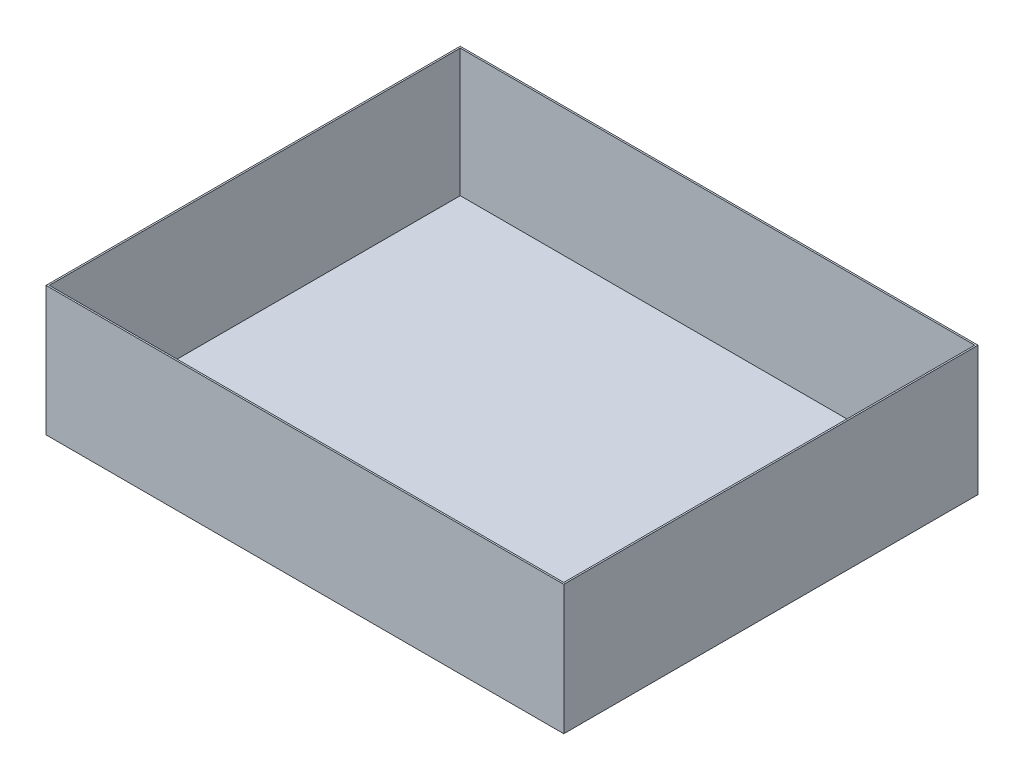
ISO-10303-21;
HEADER;
FILE_DESCRIPTION(('STEP AP214'),'2;1');
FILE_NAME('part.step','',(''),(''),'','','');
FILE_SCHEMA(('AUTOMOTIVE_DESIGN { 1 0 10303 214 1 1 1 1 }'));
ENDSEC;
DATA;
#1=APPLICATION_CONTEXT('core data for automotive mechanical design processes');
#2=APPLICATION_PROTOCOL_DEFINITION('international standard','automotive_design',2000,#1);
#3=PRODUCT_CONTEXT('',#1,'mechanical');
#4=PRODUCT('Part','Part','',(#3));
#5=PRODUCT_RELATED_PRODUCT_CATEGORY('part','',(#4));
#6=PRODUCT_DEFINITION_FORMATION('','',#4);
#7=PRODUCT_DEFINITION_CONTEXT('part definition',#1,'design');
#8=PRODUCT_DEFINITION('design','',#6,#7);
#9=PRODUCT_DEFINITION_SHAPE('','',#8);
#10=(LENGTH_UNIT() NAMED_UNIT(*) SI_UNIT(.MILLI.,.METRE.));
#11=(NAMED_UNIT(*) PLANE_ANGLE_UNIT() SI_UNIT($,.RADIAN.));
#12=(NAMED_UNIT(*) SI_UNIT($,.STERADIAN.) SOLID_ANGLE_UNIT());
#13=UNCERTAINTY_MEASURE_WITH_UNIT(LENGTH_MEASURE(1.E-05),#10,'distance_accuracy_value','');
#14=(GEOMETRIC_REPRESENTATION_CONTEXT(3) GLOBAL_UNCERTAINTY_ASSIGNED_CONTEXT((#13)) GLOBAL_UNIT_ASSIGNED_CONTEXT((#10,
#11,#12)) REPRESENTATION_CONTEXT('',''));
#15=CARTESIAN_POINT('',(0.,0.,0.));
#16=DIRECTION('',(0.,0.,1.));
#17=DIRECTION('',(1.,0.,0.));
#18=AXIS2_PLACEMENT_3D('',#15,#16,#17);
#19=CARTESIAN_POINT('',(0.,63.5,0.));
#20=DIRECTION('',(0.,-1.,0.));
#21=DIRECTION('',(0.,0.,-1.));
#22=AXIS2_PLACEMENT_3D('',#19,#20,#21);
#23=PLANE('',#22);
#24=DIRECTION('',(0.,0.,1.));
#25=VECTOR('',#24,1.);
#26=CARTESIAN_POINT('',(0.,63.5,0.));
#27=LINE('',#26,#25);
#28=CARTESIAN_POINT('',(0.,63.5,-203.2));
#29=VERTEX_POINT('',#28);
#30=CARTESIAN_POINT('',(0.,63.5,0.));
#31=VERTEX_POINT('',#30);
#32=EDGE_CURVE('E143',#29,#31,#27,.T.);
#33=ORIENTED_EDGE('',*,*,#32,.T.);
#34=DIRECTION('',(1.,0.,0.));
#35=VECTOR('',#34,1.);
#36=CARTESIAN_POINT('',(0.,63.5,0.));
#37=LINE('',#36,#35);
#38=CARTESIAN_POINT('',(254.,63.5,0.));
#39=VERTEX_POINT('',#38);
#40=EDGE_CURVE('E87',#31,#39,#37,.T.);
#41=ORIENTED_EDGE('',*,*,#40,.T.);
#42=DIRECTION('',(0.,0.,-1.));
#43=VECTOR('',#42,1.);
#44=CARTESIAN_POINT('',(254.,63.5,0.));
#45=LINE('',#44,#43);
#46=CARTESIAN_POINT('',(254.,63.5,-203.2));
#47=VERTEX_POINT('',#46);
#48=EDGE_CURVE('E146',#39,#47,#45,.T.);
#49=ORIENTED_EDGE('',*,*,#48,.T.);
#50=DIRECTION('',(-1.,0.,0.));
#51=VECTOR('',#50,1.);
#52=CARTESIAN_POINT('',(0.,63.5,-203.2));
#53=LINE('',#52,#51);
#54=EDGE_CURVE('E59',#47,#29,#53,.T.);
#55=ORIENTED_EDGE('',*,*,#54,.T.);
#56=EDGE_LOOP('',(#33,#41,#49,#55));
#57=FACE_BOUND('',#56,.T.);
#58=DIRECTION('',(0.,0.,1.));
#59=VECTOR('',#58,1.);
#60=CARTESIAN_POINT('',(0.79375,63.5,0.));
#61=LINE('',#60,#59);
#62=CARTESIAN_POINT('',(0.79375,63.5,-202.40625));
#63=VERTEX_POINT('',#62);
#64=CARTESIAN_POINT('',(0.79375,63.5,-0.79375));
#65=VERTEX_POINT('',#64);
#66=EDGE_CURVE('E132',#63,#65,#61,.T.);
#67=ORIENTED_EDGE('',*,*,#66,.F.);
#68=DIRECTION('',(-1.,0.,0.));
#69=VECTOR('',#68,1.);
#70=CARTESIAN_POINT('',(0.,63.5,-202.40625));
#71=LINE('',#70,#69);
#72=CARTESIAN_POINT('',(253.20625,63.5,-202.40625));
#73=VERTEX_POINT('',#72);
#74=EDGE_CURVE('E141',#73,#63,#71,.T.);
#75=ORIENTED_EDGE('',*,*,#74,.F.);
#76=DIRECTION('',(0.,0.,-1.));
#77=VECTOR('',#76,1.);
#78=CARTESIAN_POINT('',(253.20625,63.5,0.));
#79=LINE('',#78,#77);
#80=CARTESIAN_POINT('',(253.20625,63.5,-0.79375));
#81=VERTEX_POINT('',#80);
#82=EDGE_CURVE('E139',#81,#73,#79,.T.);
#83=ORIENTED_EDGE('',*,*,#82,.F.);
#84=DIRECTION('',(1.,0.,0.));
#85=VECTOR('',#84,1.);
#86=CARTESIAN_POINT('',(0.,63.5,-0.79375));
#87=LINE('',#86,#85);
#88=EDGE_CURVE('E124',#65,#81,#87,.T.);
#89=ORIENTED_EDGE('',*,*,#88,.F.);
#90=EDGE_LOOP('',(#67,#75,#83,#89));
#91=FACE_BOUND('',#90,.T.);
#92=ADVANCED_FACE('F35',(#57,#91),#23,.F.);
#93=CARTESIAN_POINT('',(0.,63.5,0.));
#94=DIRECTION('',(1.,0.,0.));
#95=DIRECTION('',(0.,0.,-1.));
#96=AXIS2_PLACEMENT_3D('',#93,#94,#95);
#97=PLANE('',#96);
#98=DIRECTION('',(0.,0.,1.));
#99=VECTOR('',#98,1.);
#100=CARTESIAN_POINT('',(0.,0.,0.));
#101=LINE('',#100,#99);
#102=CARTESIAN_POINT('',(0.,0.,-203.2));
#103=VERTEX_POINT('',#102);
#104=CARTESIAN_POINT('',(0.,0.,0.));
#105=VERTEX_POINT('',#104);
#106=EDGE_CURVE('E150',#103,#105,#101,.T.);
#107=ORIENTED_EDGE('',*,*,#106,.T.);
#108=DIRECTION('',(0.,-1.,0.));
#109=VECTOR('',#108,1.);
#110=CARTESIAN_POINT('',(0.,63.5,0.));
#111=LINE('',#110,#109);
#112=EDGE_CURVE('E11',#31,#105,#111,.T.);
#113=ORIENTED_EDGE('',*,*,#112,.F.);
#114=ORIENTED_EDGE('',*,*,#32,.F.);
#115=DIRECTION('',(0.,-1.,0.));
#116=VECTOR('',#115,1.);
#117=CARTESIAN_POINT('',(0.,63.5,-203.2));
#118=LINE('',#117,#116);
#119=EDGE_CURVE('E149',#29,#103,#118,.T.);
#120=ORIENTED_EDGE('',*,*,#119,.T.);
#121=EDGE_LOOP('',(#107,#113,#114,#120));
#122=FACE_BOUND('',#121,.T.);
#123=ADVANCED_FACE('F37',(#122),#97,.F.);
#124=CARTESIAN_POINT('',(0.,63.5,0.));
#125=DIRECTION('',(0.,0.,-1.));
#126=DIRECTION('',(-1.,0.,0.));
#127=AXIS2_PLACEMENT_3D('',#124,#125,#126);
#128=PLANE('',#127);
#129=DIRECTION('',(1.,0.,0.));
#130=VECTOR('',#129,1.);
#131=CARTESIAN_POINT('',(0.,0.,0.));
#132=LINE('',#131,#130);
#133=CARTESIAN_POINT('',(254.,0.,0.));
#134=VERTEX_POINT('',#133);
#135=EDGE_CURVE('E153',#105,#134,#132,.T.);
#136=ORIENTED_EDGE('',*,*,#135,.T.);
#137=DIRECTION('',(0.,-1.,0.));
#138=VECTOR('',#137,1.);
#139=CARTESIAN_POINT('',(254.,63.5,0.));
#140=LINE('',#139,#138);
#141=EDGE_CURVE('E43',#39,#134,#140,.T.);
#142=ORIENTED_EDGE('',*,*,#141,.F.);
#143=ORIENTED_EDGE('',*,*,#40,.F.);
#144=ORIENTED_EDGE('',*,*,#112,.T.);
#145=EDGE_LOOP('',(#136,#142,#143,#144));
#146=FACE_BOUND('',#145,.T.);
#147=ADVANCED_FACE('F181',(#146),#128,.F.);
#148=CARTESIAN_POINT('',(254.,63.5,0.));
#149=DIRECTION('',(-1.,0.,0.));
#150=DIRECTION('',(0.,0.,1.));
#151=AXIS2_PLACEMENT_3D('',#148,#149,#150);
#152=PLANE('',#151);
#153=DIRECTION('',(0.,0.,-1.));
#154=VECTOR('',#153,1.);
#155=CARTESIAN_POINT('',(254.,0.,0.));
#156=LINE('',#155,#154);
#157=CARTESIAN_POINT('',(254.,0.,-203.2));
#158=VERTEX_POINT('',#157);
#159=EDGE_CURVE('E155',#134,#158,#156,.T.);
#160=ORIENTED_EDGE('',*,*,#159,.T.);
#161=DIRECTION('',(0.,-1.,0.));
#162=VECTOR('',#161,1.);
#163=CARTESIAN_POINT('',(254.,63.5,-203.2));
#164=LINE('',#163,#162);
#165=EDGE_CURVE('E159',#47,#158,#164,.T.);
#166=ORIENTED_EDGE('',*,*,#165,.F.);
#167=ORIENTED_EDGE('',*,*,#48,.F.);
#168=ORIENTED_EDGE('',*,*,#141,.T.);
#169=EDGE_LOOP('',(#160,#166,#167,#168));
#170=FACE_BOUND('',#169,.T.);
#171=ADVANCED_FACE('F164',(#170),#152,.F.);
#172=CARTESIAN_POINT('',(0.,63.5,-203.2));
#173=DIRECTION('',(0.,0.,1.));
#174=DIRECTION('',(1.,0.,0.));
#175=AXIS2_PLACEMENT_3D('',#172,#173,#174);
#176=PLANE('',#175);
#177=DIRECTION('',(-1.,0.,0.));
#178=VECTOR('',#177,1.);
#179=CARTESIAN_POINT('',(0.,0.,-203.2));
#180=LINE('',#179,#178);
#181=EDGE_CURVE('E80',#158,#103,#180,.T.);
#182=ORIENTED_EDGE('',*,*,#181,.T.);
#183=ORIENTED_EDGE('',*,*,#119,.F.);
#184=ORIENTED_EDGE('',*,*,#54,.F.);
#185=ORIENTED_EDGE('',*,*,#165,.T.);
#186=EDGE_LOOP('',(#182,#183,#184,#185));
#187=FACE_BOUND('',#186,.T.);
#188=ADVANCED_FACE('F172',(#187),#176,.F.);
#189=CARTESIAN_POINT('',(0.,0.,0.));
#190=DIRECTION('',(0.,-1.,0.));
#191=DIRECTION('',(0.,0.,-1.));
#192=AXIS2_PLACEMENT_3D('',#189,#190,#191);
#193=PLANE('',#192);
#194=ORIENTED_EDGE('',*,*,#106,.F.);
#195=ORIENTED_EDGE('',*,*,#181,.F.);
#196=ORIENTED_EDGE('',*,*,#159,.F.);
#197=ORIENTED_EDGE('',*,*,#135,.F.);
#198=EDGE_LOOP('',(#194,#195,#196,#197));
#199=FACE_BOUND('',#198,.T.);
#200=ADVANCED_FACE('F168',(#199),#193,.T.);
#201=CARTESIAN_POINT('',(0.79375,63.5,0.));
#202=DIRECTION('',(1.,0.,0.));
#203=DIRECTION('',(0.,0.,-1.));
#204=AXIS2_PLACEMENT_3D('',#201,#202,#203);
#205=PLANE('',#204);
#206=DIRECTION('',(0.,0.,1.));
#207=VECTOR('',#206,1.);
#208=CARTESIAN_POINT('',(0.79375,0.79375,0.));
#209=LINE('',#208,#207);
#210=CARTESIAN_POINT('',(0.79375,0.79375,-202.40625));
#211=VERTEX_POINT('',#210);
#212=CARTESIAN_POINT('',(0.79375,0.79375,-0.79375));
#213=VERTEX_POINT('',#212);
#214=EDGE_CURVE('E115',#211,#213,#209,.T.);
#215=ORIENTED_EDGE('',*,*,#214,.F.);
#216=DIRECTION('',(0.,-1.,0.));
#217=VECTOR('',#216,1.);
#218=CARTESIAN_POINT('',(0.79375,63.5,-202.40625));
#219=LINE('',#218,#217);
#220=EDGE_CURVE('E135',#63,#211,#219,.T.);
#221=ORIENTED_EDGE('',*,*,#220,.F.);
#222=ORIENTED_EDGE('',*,*,#66,.T.);
#223=DIRECTION('',(0.,-1.,0.));
#224=VECTOR('',#223,1.);
#225=CARTESIAN_POINT('',(0.79375,63.5,-0.79375));
#226=LINE('',#225,#224);
#227=EDGE_CURVE('E127',#65,#213,#226,.T.);
#228=ORIENTED_EDGE('',*,*,#227,.T.);
#229=EDGE_LOOP('',(#215,#221,#222,#228));
#230=FACE_BOUND('',#229,.T.);
#231=ADVANCED_FACE('F179',(#230),#205,.T.);
#232=CARTESIAN_POINT('',(0.,63.5,-0.79375));
#233=DIRECTION('',(0.,0.,-1.));
#234=DIRECTION('',(-1.,0.,0.));
#235=AXIS2_PLACEMENT_3D('',#232,#233,#234);
#236=PLANE('',#235);
#237=DIRECTION('',(1.,0.,0.));
#238=VECTOR('',#237,1.);
#239=CARTESIAN_POINT('',(0.,0.79375,-0.79375));
#240=LINE('',#239,#238);
#241=CARTESIAN_POINT('',(253.20625,0.79375,-0.79375));
#242=VERTEX_POINT('',#241);
#243=EDGE_CURVE('E109',#213,#242,#240,.T.);
#244=ORIENTED_EDGE('',*,*,#243,.F.);
#245=ORIENTED_EDGE('',*,*,#227,.F.);
#246=ORIENTED_EDGE('',*,*,#88,.T.);
#247=DIRECTION('',(0.,-1.,0.));
#248=VECTOR('',#247,1.);
#249=CARTESIAN_POINT('',(253.20625,63.5,-0.79375));
#250=LINE('',#249,#248);
#251=EDGE_CURVE('E121',#81,#242,#250,.T.);
#252=ORIENTED_EDGE('',*,*,#251,.T.);
#253=EDGE_LOOP('',(#244,#245,#246,#252));
#254=FACE_BOUND('',#253,.T.);
#255=ADVANCED_FACE('F122',(#254),#236,.T.);
#256=CARTESIAN_POINT('',(253.20625,63.5,0.));
#257=DIRECTION('',(-1.,0.,0.));
#258=DIRECTION('',(0.,0.,1.));
#259=AXIS2_PLACEMENT_3D('',#256,#257,#258);
#260=PLANE('',#259);
#261=DIRECTION('',(0.,0.,-1.));
#262=VECTOR('',#261,1.);
#263=CARTESIAN_POINT('',(253.20625,0.79375,0.));
#264=LINE('',#263,#262);
#265=CARTESIAN_POINT('',(253.20625,0.79375,-202.40625));
#266=VERTEX_POINT('',#265);
#267=EDGE_CURVE('E113',#242,#266,#264,.T.);
#268=ORIENTED_EDGE('',*,*,#267,.F.);
#269=ORIENTED_EDGE('',*,*,#251,.F.);
#270=ORIENTED_EDGE('',*,*,#82,.T.);
#271=DIRECTION('',(0.,-1.,0.));
#272=VECTOR('',#271,1.);
#273=CARTESIAN_POINT('',(253.20625,63.5,-202.40625));
#274=LINE('',#273,#272);
#275=EDGE_CURVE('E50',#73,#266,#274,.T.);
#276=ORIENTED_EDGE('',*,*,#275,.T.);
#277=EDGE_LOOP('',(#268,#269,#270,#276));
#278=FACE_BOUND('',#277,.T.);
#279=ADVANCED_FACE('F129',(#278),#260,.T.);
#280=CARTESIAN_POINT('',(0.,63.5,-202.40625));
#281=DIRECTION('',(0.,0.,1.));
#282=DIRECTION('',(1.,0.,0.));
#283=AXIS2_PLACEMENT_3D('',#280,#281,#282);
#284=PLANE('',#283);
#285=DIRECTION('',(-1.,0.,0.));
#286=VECTOR('',#285,1.);
#287=CARTESIAN_POINT('',(0.,0.79375,-202.40625));
#288=LINE('',#287,#286);
#289=EDGE_CURVE('E130',#266,#211,#288,.T.);
#290=ORIENTED_EDGE('',*,*,#289,.F.);
#291=ORIENTED_EDGE('',*,*,#275,.F.);
#292=ORIENTED_EDGE('',*,*,#74,.T.);
#293=ORIENTED_EDGE('',*,*,#220,.T.);
#294=EDGE_LOOP('',(#290,#291,#292,#293));
#295=FACE_BOUND('',#294,.T.);
#296=ADVANCED_FACE('F192',(#295),#284,.T.);
#297=CARTESIAN_POINT('',(0.,0.79375,0.));
#298=DIRECTION('',(0.,-1.,0.));
#299=DIRECTION('',(0.,0.,-1.));
#300=AXIS2_PLACEMENT_3D('',#297,#298,#299);
#301=PLANE('',#300);
#302=ORIENTED_EDGE('',*,*,#214,.T.);
#303=ORIENTED_EDGE('',*,*,#243,.T.);
#304=ORIENTED_EDGE('',*,*,#267,.T.);
#305=ORIENTED_EDGE('',*,*,#289,.T.);
#306=EDGE_LOOP('',(#302,#303,#304,#305));
#307=FACE_BOUND('',#306,.T.);
#308=ADVANCED_FACE('F111',(#307),#301,.F.);
#309=CLOSED_SHELL('',(#92,#123,#147,#171,#188,#200,#231,#255,#279,#296,#308));
#310=MANIFOLD_SOLID_BREP('B2',#309);
#311=ADVANCED_BREP_SHAPE_REPRESENTATION('',(#18,#310),#14);
#312=SHAPE_DEFINITION_REPRESENTATION(#9,#311);
ENDSEC;
END-ISO-10303-21;
